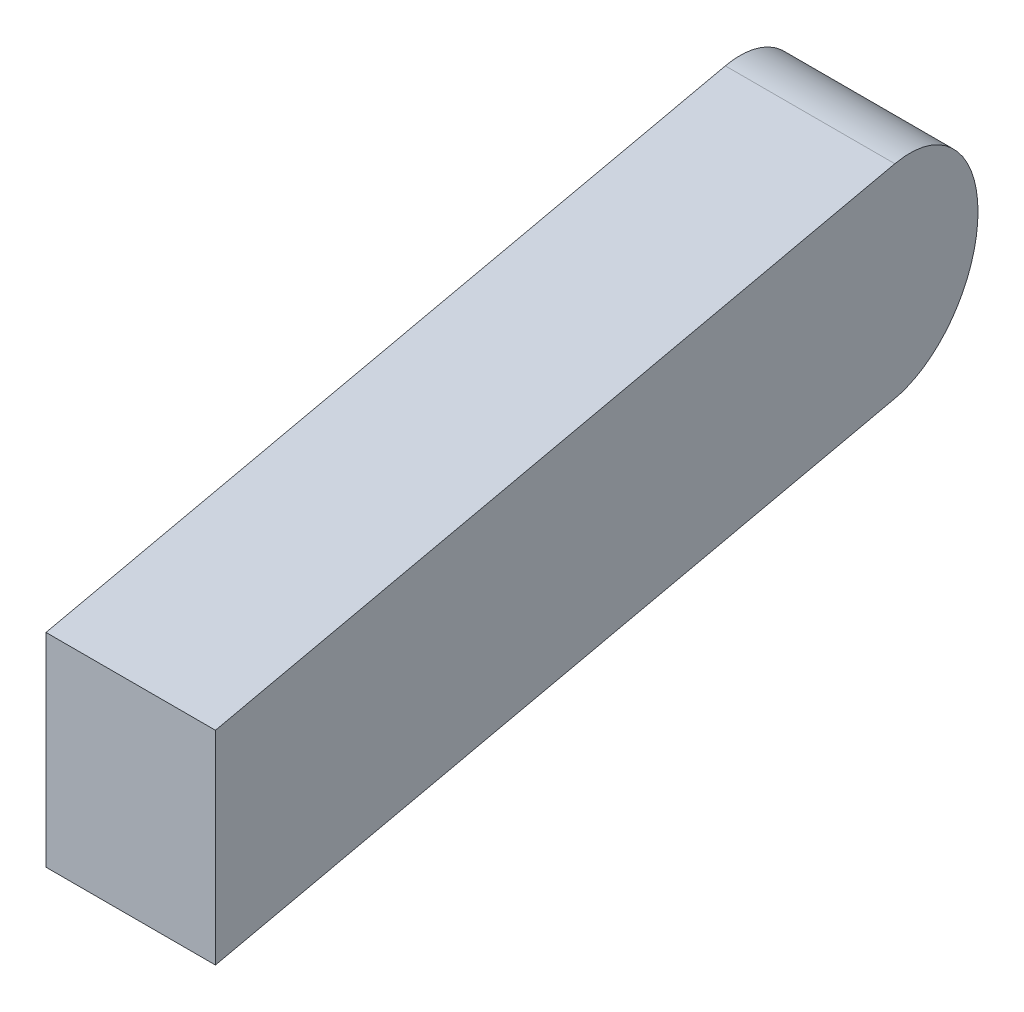
ISO-10303-21;
HEADER;
FILE_DESCRIPTION(('STEP AP214'),'2;1');
FILE_NAME('part.step','',(''),(''),'','','');
FILE_SCHEMA(('AUTOMOTIVE_DESIGN { 1 0 10303 214 1 1 1 1 }'));
ENDSEC;
DATA;
#1=APPLICATION_CONTEXT('core data for automotive mechanical design processes');
#2=APPLICATION_PROTOCOL_DEFINITION('international standard','automotive_design',2000,#1);
#3=PRODUCT_CONTEXT('',#1,'mechanical');
#4=PRODUCT('Part','Part','',(#3));
#5=PRODUCT_RELATED_PRODUCT_CATEGORY('part','',(#4));
#6=PRODUCT_DEFINITION_FORMATION('','',#4);
#7=PRODUCT_DEFINITION_CONTEXT('part definition',#1,'design');
#8=PRODUCT_DEFINITION('design','',#6,#7);
#9=PRODUCT_DEFINITION_SHAPE('','',#8);
#10=(LENGTH_UNIT() NAMED_UNIT(*) SI_UNIT(.MILLI.,.METRE.));
#11=(NAMED_UNIT(*) PLANE_ANGLE_UNIT() SI_UNIT($,.RADIAN.));
#12=(NAMED_UNIT(*) SI_UNIT($,.STERADIAN.) SOLID_ANGLE_UNIT());
#13=UNCERTAINTY_MEASURE_WITH_UNIT(LENGTH_MEASURE(1.E-05),#10,'distance_accuracy_value','');
#14=(GEOMETRIC_REPRESENTATION_CONTEXT(3) GLOBAL_UNCERTAINTY_ASSIGNED_CONTEXT((#13)) GLOBAL_UNIT_ASSIGNED_CONTEXT((#10,
#11,#12)) REPRESENTATION_CONTEXT('',''));
#15=CARTESIAN_POINT('',(0.,0.,0.));
#16=DIRECTION('',(0.,0.,1.));
#17=DIRECTION('',(1.,0.,0.));
#18=AXIS2_PLACEMENT_3D('',#15,#16,#17);
#19=CARTESIAN_POINT('',(-1.,0.6,-5.5));
#20=DIRECTION('',(0.983869910099908,0.,-0.178885438199983));
#21=DIRECTION('',(-0.178885438199983,0.,-0.983869910099908));
#22=AXIS2_PLACEMENT_3D('',#19,#20,#21);
#23=PLANE('',#22);
#24=DIRECTION('',(0.178885438199983,0.,0.983869910099908));
#25=VECTOR('',#24,1.);
#26=CARTESIAN_POINT('',(-1.,0.6,-5.5));
#27=LINE('',#26,#25);
#28=CARTESIAN_POINT('',(-0.890909090909091,0.6,-4.9));
#29=VERTEX_POINT('',#28);
#30=CARTESIAN_POINT('',(0.,0.6,0.));
#31=VERTEX_POINT('',#30);
#32=EDGE_CURVE('E90',#29,#31,#27,.T.);
#33=ORIENTED_EDGE('',*,*,#32,.F.);
#34=CARTESIAN_POINT('',(-0.890909090909091,0.,-4.9));
#35=DIRECTION('',(0.983869910099908,0.,-0.178885438199983));
#36=DIRECTION('',(0.178885438199983,0.,0.983869910099908));
#37=AXIS2_PLACEMENT_3D('',#34,#35,#36);
#38=ELLIPSE('',#37,0.609836721136306,0.6);
#39=CARTESIAN_POINT('',(-0.890909090909091,-0.6,-4.9));
#40=VERTEX_POINT('',#39);
#41=EDGE_CURVE('E99',#29,#40,#38,.F.);
#42=ORIENTED_EDGE('',*,*,#41,.T.);
#43=DIRECTION('',(0.178885438199983,0.,0.983869910099908));
#44=VECTOR('',#43,1.);
#45=CARTESIAN_POINT('',(-1.,-0.6,-5.5));
#46=LINE('',#45,#44);
#47=CARTESIAN_POINT('',(0.,-0.6,0.));
#48=VERTEX_POINT('',#47);
#49=EDGE_CURVE('E82',#40,#48,#46,.T.);
#50=ORIENTED_EDGE('',*,*,#49,.T.);
#51=DIRECTION('',(0.,-1.,0.));
#52=VECTOR('',#51,1.);
#53=CARTESIAN_POINT('',(0.,0.6,0.));
#54=LINE('',#53,#52);
#55=EDGE_CURVE('E77',#31,#48,#54,.T.);
#56=ORIENTED_EDGE('',*,*,#55,.F.);
#57=EDGE_LOOP('',(#33,#42,#50,#56));
#58=FACE_BOUND('',#57,.T.);
#59=ADVANCED_FACE('F36',(#58),#23,.F.);
#60=CARTESIAN_POINT('',(1.,0.6,0.));
#61=DIRECTION('',(-0.983869910099908,0.,0.178885438199983));
#62=DIRECTION('',(0.178885438199983,0.,0.983869910099908));
#63=AXIS2_PLACEMENT_3D('',#60,#61,#62);
#64=PLANE('',#63);
#65=CARTESIAN_POINT('',(0.109090909090909,0.,-4.9));
#66=DIRECTION('',(-0.983869910099908,0.,0.178885438199983));
#67=DIRECTION('',(0.178885438199983,0.,0.983869910099908));
#68=AXIS2_PLACEMENT_3D('',#65,#66,#67);
#69=ELLIPSE('',#68,0.609836721136306,0.6);
#70=CARTESIAN_POINT('',(0.109090909090909,-0.6,-4.9));
#71=VERTEX_POINT('',#70);
#72=CARTESIAN_POINT('',(0.109090909090909,0.6,-4.9));
#73=VERTEX_POINT('',#72);
#74=EDGE_CURVE('E49',#71,#73,#69,.F.);
#75=ORIENTED_EDGE('',*,*,#74,.T.);
#76=DIRECTION('',(-0.178885438199983,0.,-0.983869910099908));
#77=VECTOR('',#76,1.);
#78=CARTESIAN_POINT('',(1.,0.6,0.));
#79=LINE('',#78,#77);
#80=CARTESIAN_POINT('',(1.,0.6,0.));
#81=VERTEX_POINT('',#80);
#82=EDGE_CURVE('E87',#81,#73,#79,.T.);
#83=ORIENTED_EDGE('',*,*,#82,.F.);
#84=DIRECTION('',(0.,-1.,0.));
#85=VECTOR('',#84,1.);
#86=CARTESIAN_POINT('',(1.,0.6,0.));
#87=LINE('',#86,#85);
#88=CARTESIAN_POINT('',(1.,-0.6,0.));
#89=VERTEX_POINT('',#88);
#90=EDGE_CURVE('E74',#81,#89,#87,.T.);
#91=ORIENTED_EDGE('',*,*,#90,.T.);
#92=DIRECTION('',(-0.178885438199983,0.,-0.983869910099908));
#93=VECTOR('',#92,1.);
#94=CARTESIAN_POINT('',(1.,-0.6,0.));
#95=LINE('',#94,#93);
#96=EDGE_CURVE('E81',#89,#71,#95,.T.);
#97=ORIENTED_EDGE('',*,*,#96,.T.);
#98=EDGE_LOOP('',(#75,#83,#91,#97));
#99=FACE_BOUND('',#98,.T.);
#100=ADVANCED_FACE('F86',(#99),#64,.F.);
#101=CARTESIAN_POINT('',(0.,-0.6,0.));
#102=DIRECTION('',(0.,1.,0.));
#103=DIRECTION('',(0.,0.,1.));
#104=AXIS2_PLACEMENT_3D('',#101,#102,#103);
#105=PLANE('',#104);
#106=DIRECTION('',(1.,0.,0.));
#107=VECTOR('',#106,1.);
#108=CARTESIAN_POINT('',(-1.,-0.6,-4.9));
#109=LINE('',#108,#107);
#110=EDGE_CURVE('E43',#71,#40,#109,.F.);
#111=ORIENTED_EDGE('',*,*,#110,.F.);
#112=ORIENTED_EDGE('',*,*,#96,.F.);
#113=DIRECTION('',(1.,0.,0.));
#114=VECTOR('',#113,1.);
#115=CARTESIAN_POINT('',(0.,-0.6,0.));
#116=LINE('',#115,#114);
#117=EDGE_CURVE('E71',#48,#89,#116,.T.);
#118=ORIENTED_EDGE('',*,*,#117,.F.);
#119=ORIENTED_EDGE('',*,*,#49,.F.);
#120=EDGE_LOOP('',(#111,#112,#118,#119));
#121=FACE_BOUND('',#120,.T.);
#122=ADVANCED_FACE('F89',(#121),#105,.F.);
#123=CARTESIAN_POINT('',(0.,0.6,0.));
#124=DIRECTION('',(0.,0.,-1.));
#125=DIRECTION('',(-1.,0.,0.));
#126=AXIS2_PLACEMENT_3D('',#123,#124,#125);
#127=PLANE('',#126);
#128=ORIENTED_EDGE('',*,*,#117,.T.);
#129=ORIENTED_EDGE('',*,*,#90,.F.);
#130=DIRECTION('',(1.,0.,0.));
#131=VECTOR('',#130,1.);
#132=CARTESIAN_POINT('',(0.,0.6,0.));
#133=LINE('',#132,#131);
#134=EDGE_CURVE('E58',#31,#81,#133,.T.);
#135=ORIENTED_EDGE('',*,*,#134,.F.);
#136=ORIENTED_EDGE('',*,*,#55,.T.);
#137=EDGE_LOOP('',(#128,#129,#135,#136));
#138=FACE_BOUND('',#137,.T.);
#139=ADVANCED_FACE('F73',(#138),#127,.F.);
#140=CARTESIAN_POINT('',(0.,0.6,0.));
#141=DIRECTION('',(0.,1.,0.));
#142=DIRECTION('',(0.,0.,1.));
#143=AXIS2_PLACEMENT_3D('',#140,#141,#142);
#144=PLANE('',#143);
#145=DIRECTION('',(1.,0.,0.));
#146=VECTOR('',#145,1.);
#147=CARTESIAN_POINT('',(-1.,0.6,-4.9));
#148=LINE('',#147,#146);
#149=EDGE_CURVE('E11',#29,#73,#148,.T.);
#150=ORIENTED_EDGE('',*,*,#149,.F.);
#151=ORIENTED_EDGE('',*,*,#32,.T.);
#152=ORIENTED_EDGE('',*,*,#134,.T.);
#153=ORIENTED_EDGE('',*,*,#82,.T.);
#154=EDGE_LOOP('',(#150,#151,#152,#153));
#155=FACE_BOUND('',#154,.T.);
#156=ADVANCED_FACE('F109',(#155),#144,.T.);
#157=CARTESIAN_POINT('',(-1.,0.,-4.9));
#158=DIRECTION('',(1.,0.,0.));
#159=DIRECTION('',(0.,0.,-1.));
#160=AXIS2_PLACEMENT_3D('',#157,#158,#159);
#161=CYLINDRICAL_SURFACE('',#160,0.6);
#162=ORIENTED_EDGE('',*,*,#41,.F.);
#163=ORIENTED_EDGE('',*,*,#149,.T.);
#164=ORIENTED_EDGE('',*,*,#74,.F.);
#165=ORIENTED_EDGE('',*,*,#110,.T.);
#166=EDGE_LOOP('',(#162,#163,#164,#165));
#167=FACE_BOUND('',#166,.T.);
#168=ADVANCED_FACE('F97',(#167),#161,.T.);
#169=CLOSED_SHELL('',(#59,#100,#122,#139,#156,#168));
#170=MANIFOLD_SOLID_BREP('B2',#169);
#171=ADVANCED_BREP_SHAPE_REPRESENTATION('',(#18,#170),#14);
#172=SHAPE_DEFINITION_REPRESENTATION(#9,#171);
ENDSEC;
END-ISO-10303-21;
